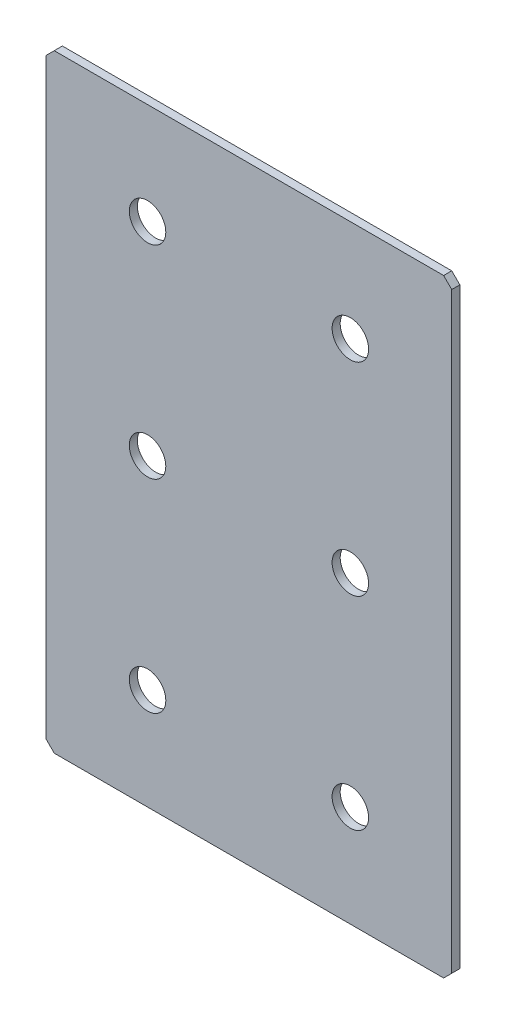
ISO-10303-21;
HEADER;
FILE_DESCRIPTION(('STEP AP214'),'2;1');
FILE_NAME('part.step','',(''),(''),'','','');
FILE_SCHEMA(('AUTOMOTIVE_DESIGN { 1 0 10303 214 1 1 1 1 }'));
ENDSEC;
DATA;
#1=APPLICATION_CONTEXT('core data for automotive mechanical design processes');
#2=APPLICATION_PROTOCOL_DEFINITION('international standard','automotive_design',2000,#1);
#3=PRODUCT_CONTEXT('',#1,'mechanical');
#4=PRODUCT('Part','Part','',(#3));
#5=PRODUCT_RELATED_PRODUCT_CATEGORY('part','',(#4));
#6=PRODUCT_DEFINITION_FORMATION('','',#4);
#7=PRODUCT_DEFINITION_CONTEXT('part definition',#1,'design');
#8=PRODUCT_DEFINITION('design','',#6,#7);
#9=PRODUCT_DEFINITION_SHAPE('','',#8);
#10=(LENGTH_UNIT() NAMED_UNIT(*) SI_UNIT(.MILLI.,.METRE.));
#11=(NAMED_UNIT(*) PLANE_ANGLE_UNIT() SI_UNIT($,.RADIAN.));
#12=(NAMED_UNIT(*) SI_UNIT($,.STERADIAN.) SOLID_ANGLE_UNIT());
#13=UNCERTAINTY_MEASURE_WITH_UNIT(LENGTH_MEASURE(1.E-05),#10,'distance_accuracy_value','');
#14=(GEOMETRIC_REPRESENTATION_CONTEXT(3) GLOBAL_UNCERTAINTY_ASSIGNED_CONTEXT((#13)) GLOBAL_UNIT_ASSIGNED_CONTEXT((#10,
#11,#12)) REPRESENTATION_CONTEXT('',''));
#15=CARTESIAN_POINT('',(0.,0.,0.));
#16=DIRECTION('',(0.,0.,1.));
#17=DIRECTION('',(1.,0.,0.));
#18=AXIS2_PLACEMENT_3D('',#15,#16,#17);
#19=CARTESIAN_POINT('',(50.,-75.,2.));
#20=DIRECTION('',(-1.,0.,0.));
#21=DIRECTION('',(0.,0.,1.));
#22=AXIS2_PLACEMENT_3D('',#19,#20,#21);
#23=PLANE('',#22);
#24=DIRECTION('',(0.,1.,0.));
#25=VECTOR('',#24,1.);
#26=CARTESIAN_POINT('',(50.,-75.,2.));
#27=LINE('',#26,#25);
#28=CARTESIAN_POINT('',(50.,-73.,2.));
#29=VERTEX_POINT('',#28);
#30=CARTESIAN_POINT('',(50.,73.,2.));
#31=VERTEX_POINT('',#30);
#32=EDGE_CURVE('E128',#29,#31,#27,.T.);
#33=ORIENTED_EDGE('',*,*,#32,.F.);
#34=DIRECTION('',(0.,0.,-1.));
#35=VECTOR('',#34,1.);
#36=CARTESIAN_POINT('',(50.,-73.,2.));
#37=LINE('',#36,#35);
#38=CARTESIAN_POINT('',(50.,-73.,0.));
#39=VERTEX_POINT('',#38);
#40=EDGE_CURVE('E154',#29,#39,#37,.T.);
#41=ORIENTED_EDGE('',*,*,#40,.T.);
#42=DIRECTION('',(0.,1.,0.));
#43=VECTOR('',#42,1.);
#44=CARTESIAN_POINT('',(50.,-75.,0.));
#45=LINE('',#44,#43);
#46=CARTESIAN_POINT('',(50.,73.,0.));
#47=VERTEX_POINT('',#46);
#48=EDGE_CURVE('E162',#39,#47,#45,.T.);
#49=ORIENTED_EDGE('',*,*,#48,.T.);
#50=DIRECTION('',(0.,0.,1.));
#51=VECTOR('',#50,1.);
#52=CARTESIAN_POINT('',(50.,73.,2.));
#53=LINE('',#52,#51);
#54=EDGE_CURVE('E152',#47,#31,#53,.T.);
#55=ORIENTED_EDGE('',*,*,#54,.T.);
#56=EDGE_LOOP('',(#33,#41,#49,#55));
#57=FACE_BOUND('',#56,.T.);
#58=ADVANCED_FACE('F37',(#57),#23,.F.);
#59=CARTESIAN_POINT('',(-50.,75.,2.));
#60=DIRECTION('',(0.,-1.,0.));
#61=DIRECTION('',(0.,0.,-1.));
#62=AXIS2_PLACEMENT_3D('',#59,#60,#61);
#63=PLANE('',#62);
#64=DIRECTION('',(-1.,0.,0.));
#65=VECTOR('',#64,1.);
#66=CARTESIAN_POINT('',(-50.,75.,0.));
#67=LINE('',#66,#65);
#68=CARTESIAN_POINT('',(48.,75.,0.));
#69=VERTEX_POINT('',#68);
#70=CARTESIAN_POINT('',(-48.,75.,0.));
#71=VERTEX_POINT('',#70);
#72=EDGE_CURVE('E133',#69,#71,#67,.T.);
#73=ORIENTED_EDGE('',*,*,#72,.T.);
#74=DIRECTION('',(0.,0.,1.));
#75=VECTOR('',#74,1.);
#76=CARTESIAN_POINT('',(-48.,75.,2.));
#77=LINE('',#76,#75);
#78=CARTESIAN_POINT('',(-48.,75.,2.));
#79=VERTEX_POINT('',#78);
#80=EDGE_CURVE('E11',#71,#79,#77,.T.);
#81=ORIENTED_EDGE('',*,*,#80,.T.);
#82=DIRECTION('',(-1.,0.,0.));
#83=VECTOR('',#82,1.);
#84=CARTESIAN_POINT('',(-50.,75.,2.));
#85=LINE('',#84,#83);
#86=CARTESIAN_POINT('',(48.,75.,2.));
#87=VERTEX_POINT('',#86);
#88=EDGE_CURVE('E131',#87,#79,#85,.T.);
#89=ORIENTED_EDGE('',*,*,#88,.F.);
#90=DIRECTION('',(0.,0.,-1.));
#91=VECTOR('',#90,1.);
#92=CARTESIAN_POINT('',(48.,75.,2.));
#93=LINE('',#92,#91);
#94=EDGE_CURVE('E45',#87,#69,#93,.T.);
#95=ORIENTED_EDGE('',*,*,#94,.T.);
#96=EDGE_LOOP('',(#73,#81,#89,#95));
#97=FACE_BOUND('',#96,.T.);
#98=ADVANCED_FACE('F159',(#97),#63,.F.);
#99=CARTESIAN_POINT('',(-50.,-75.,2.));
#100=DIRECTION('',(1.,0.,0.));
#101=DIRECTION('',(0.,0.,-1.));
#102=AXIS2_PLACEMENT_3D('',#99,#100,#101);
#103=PLANE('',#102);
#104=DIRECTION('',(0.,-1.,0.));
#105=VECTOR('',#104,1.);
#106=CARTESIAN_POINT('',(-50.,-75.,0.));
#107=LINE('',#106,#105);
#108=CARTESIAN_POINT('',(-50.,73.,0.));
#109=VERTEX_POINT('',#108);
#110=CARTESIAN_POINT('',(-50.,-73.,0.));
#111=VERTEX_POINT('',#110);
#112=EDGE_CURVE('E129',#109,#111,#107,.T.);
#113=ORIENTED_EDGE('',*,*,#112,.T.);
#114=DIRECTION('',(0.,0.,1.));
#115=VECTOR('',#114,1.);
#116=CARTESIAN_POINT('',(-50.,-73.,2.));
#117=LINE('',#116,#115);
#118=CARTESIAN_POINT('',(-50.,-73.,2.));
#119=VERTEX_POINT('',#118);
#120=EDGE_CURVE('E107',#111,#119,#117,.T.);
#121=ORIENTED_EDGE('',*,*,#120,.T.);
#122=DIRECTION('',(0.,-1.,0.));
#123=VECTOR('',#122,1.);
#124=CARTESIAN_POINT('',(-50.,-75.,2.));
#125=LINE('',#124,#123);
#126=CARTESIAN_POINT('',(-50.,73.,2.));
#127=VERTEX_POINT('',#126);
#128=EDGE_CURVE('E167',#127,#119,#125,.T.);
#129=ORIENTED_EDGE('',*,*,#128,.F.);
#130=DIRECTION('',(0.,0.,-1.));
#131=VECTOR('',#130,1.);
#132=CARTESIAN_POINT('',(-50.,73.,2.));
#133=LINE('',#132,#131);
#134=EDGE_CURVE('E112',#127,#109,#133,.T.);
#135=ORIENTED_EDGE('',*,*,#134,.T.);
#136=EDGE_LOOP('',(#113,#121,#129,#135));
#137=FACE_BOUND('',#136,.T.);
#138=ADVANCED_FACE('F226',(#137),#103,.F.);
#139=CARTESIAN_POINT('',(-50.,-75.,2.));
#140=DIRECTION('',(0.,1.,0.));
#141=DIRECTION('',(0.,0.,1.));
#142=AXIS2_PLACEMENT_3D('',#139,#140,#141);
#143=PLANE('',#142);
#144=DIRECTION('',(1.,0.,0.));
#145=VECTOR('',#144,1.);
#146=CARTESIAN_POINT('',(-50.,-75.,2.));
#147=LINE('',#146,#145);
#148=CARTESIAN_POINT('',(-48.,-75.,2.));
#149=VERTEX_POINT('',#148);
#150=CARTESIAN_POINT('',(48.,-75.,2.));
#151=VERTEX_POINT('',#150);
#152=EDGE_CURVE('E122',#149,#151,#147,.T.);
#153=ORIENTED_EDGE('',*,*,#152,.F.);
#154=DIRECTION('',(0.,0.,-1.));
#155=VECTOR('',#154,1.);
#156=CARTESIAN_POINT('',(-48.,-75.,2.));
#157=LINE('',#156,#155);
#158=CARTESIAN_POINT('',(-48.,-75.,0.));
#159=VERTEX_POINT('',#158);
#160=EDGE_CURVE('E106',#149,#159,#157,.T.);
#161=ORIENTED_EDGE('',*,*,#160,.T.);
#162=DIRECTION('',(1.,0.,0.));
#163=VECTOR('',#162,1.);
#164=CARTESIAN_POINT('',(-50.,-75.,0.));
#165=LINE('',#164,#163);
#166=CARTESIAN_POINT('',(48.,-75.,0.));
#167=VERTEX_POINT('',#166);
#168=EDGE_CURVE('E119',#159,#167,#165,.T.);
#169=ORIENTED_EDGE('',*,*,#168,.T.);
#170=DIRECTION('',(0.,0.,1.));
#171=VECTOR('',#170,1.);
#172=CARTESIAN_POINT('',(48.,-75.,2.));
#173=LINE('',#172,#171);
#174=EDGE_CURVE('E124',#167,#151,#173,.T.);
#175=ORIENTED_EDGE('',*,*,#174,.T.);
#176=EDGE_LOOP('',(#153,#161,#169,#175));
#177=FACE_BOUND('',#176,.T.);
#178=ADVANCED_FACE('F118',(#177),#143,.F.);
#179=CARTESIAN_POINT('',(0.,0.,2.));
#180=DIRECTION('',(0.,0.,-1.));
#181=DIRECTION('',(-1.,0.,0.));
#182=AXIS2_PLACEMENT_3D('',#179,#180,#181);
#183=PLANE('',#182);
#184=CARTESIAN_POINT('',(-25.,50.,2.));
#185=DIRECTION('',(0.,0.,1.));
#186=DIRECTION('',(1.,0.,0.));
#187=AXIS2_PLACEMENT_3D('',#184,#185,#186);
#188=CIRCLE('',#187,4.49999999999999);
#189=CARTESIAN_POINT('',(-20.5,50.,2.));
#190=VERTEX_POINT('',#189);
#191=EDGE_CURVE('E203',#190,#190,#188,.T.);
#192=ORIENTED_EDGE('',*,*,#191,.F.);
#193=EDGE_LOOP('',(#192));
#194=FACE_BOUND('',#193,.T.);
#195=CARTESIAN_POINT('',(25.,50.,2.));
#196=DIRECTION('',(0.,0.,1.));
#197=DIRECTION('',(1.,0.,0.));
#198=AXIS2_PLACEMENT_3D('',#195,#196,#197);
#199=CIRCLE('',#198,4.49999999999999);
#200=CARTESIAN_POINT('',(29.5,50.,2.));
#201=VERTEX_POINT('',#200);
#202=EDGE_CURVE('E197',#201,#201,#199,.T.);
#203=ORIENTED_EDGE('',*,*,#202,.F.);
#204=EDGE_LOOP('',(#203));
#205=FACE_BOUND('',#204,.T.);
#206=CARTESIAN_POINT('',(25.,0.,2.));
#207=DIRECTION('',(0.,0.,1.));
#208=DIRECTION('',(1.,0.,0.));
#209=AXIS2_PLACEMENT_3D('',#206,#207,#208);
#210=CIRCLE('',#209,4.49999999999999);
#211=CARTESIAN_POINT('',(29.5,0.,2.));
#212=VERTEX_POINT('',#211);
#213=EDGE_CURVE('E191',#212,#212,#210,.T.);
#214=ORIENTED_EDGE('',*,*,#213,.F.);
#215=EDGE_LOOP('',(#214));
#216=FACE_BOUND('',#215,.T.);
#217=CARTESIAN_POINT('',(-25.,0.,2.));
#218=DIRECTION('',(0.,0.,1.));
#219=DIRECTION('',(1.,0.,0.));
#220=AXIS2_PLACEMENT_3D('',#217,#218,#219);
#221=CIRCLE('',#220,4.49999999999999);
#222=CARTESIAN_POINT('',(-20.5,0.,2.));
#223=VERTEX_POINT('',#222);
#224=EDGE_CURVE('E185',#223,#223,#221,.T.);
#225=ORIENTED_EDGE('',*,*,#224,.F.);
#226=EDGE_LOOP('',(#225));
#227=FACE_BOUND('',#226,.T.);
#228=CARTESIAN_POINT('',(-25.,-50.,2.));
#229=DIRECTION('',(0.,0.,1.));
#230=DIRECTION('',(1.,0.,0.));
#231=AXIS2_PLACEMENT_3D('',#228,#229,#230);
#232=CIRCLE('',#231,4.49999999999999);
#233=CARTESIAN_POINT('',(-20.5,-50.,2.));
#234=VERTEX_POINT('',#233);
#235=EDGE_CURVE('E179',#234,#234,#232,.T.);
#236=ORIENTED_EDGE('',*,*,#235,.F.);
#237=EDGE_LOOP('',(#236));
#238=FACE_BOUND('',#237,.T.);
#239=CARTESIAN_POINT('',(25.,-50.,2.));
#240=DIRECTION('',(0.,0.,1.));
#241=DIRECTION('',(1.,0.,0.));
#242=AXIS2_PLACEMENT_3D('',#239,#240,#241);
#243=CIRCLE('',#242,4.49999999999999);
#244=CARTESIAN_POINT('',(29.5,-50.,2.));
#245=VERTEX_POINT('',#244);
#246=EDGE_CURVE('E173',#245,#245,#243,.T.);
#247=ORIENTED_EDGE('',*,*,#246,.F.);
#248=EDGE_LOOP('',(#247));
#249=FACE_BOUND('',#248,.T.);
#250=ORIENTED_EDGE('',*,*,#128,.T.);
#251=DIRECTION('',(-0.707106781186548,0.707106781186548,0.));
#252=VECTOR('',#251,1.);
#253=CARTESIAN_POINT('',(-48.,-75.,2.));
#254=LINE('',#253,#252);
#255=EDGE_CURVE('E150',#119,#149,#254,.F.);
#256=ORIENTED_EDGE('',*,*,#255,.T.);
#257=ORIENTED_EDGE('',*,*,#152,.T.);
#258=DIRECTION('',(-0.707106781186548,-0.707106781186548,0.));
#259=VECTOR('',#258,1.);
#260=CARTESIAN_POINT('',(50.,-73.,2.));
#261=LINE('',#260,#259);
#262=EDGE_CURVE('E148',#151,#29,#261,.F.);
#263=ORIENTED_EDGE('',*,*,#262,.T.);
#264=ORIENTED_EDGE('',*,*,#32,.T.);
#265=DIRECTION('',(0.707106781186548,-0.707106781186548,0.));
#266=VECTOR('',#265,1.);
#267=CARTESIAN_POINT('',(48.,75.,2.));
#268=LINE('',#267,#266);
#269=EDGE_CURVE('E57',#31,#87,#268,.F.);
#270=ORIENTED_EDGE('',*,*,#269,.T.);
#271=ORIENTED_EDGE('',*,*,#88,.T.);
#272=DIRECTION('',(0.707106781186548,0.707106781186548,0.));
#273=VECTOR('',#272,1.);
#274=CARTESIAN_POINT('',(-50.,73.,2.));
#275=LINE('',#274,#273);
#276=EDGE_CURVE('E146',#79,#127,#275,.F.);
#277=ORIENTED_EDGE('',*,*,#276,.T.);
#278=EDGE_LOOP('',(#250,#256,#257,#263,#264,#270,#271,#277));
#279=FACE_BOUND('',#278,.T.);
#280=ADVANCED_FACE('F209',(#194,#205,#216,#227,#238,#249,#279),#183,.F.);
#281=CARTESIAN_POINT('',(0.,0.,0.));
#282=DIRECTION('',(0.,0.,-1.));
#283=DIRECTION('',(-1.,0.,0.));
#284=AXIS2_PLACEMENT_3D('',#281,#282,#283);
#285=PLANE('',#284);
#286=CARTESIAN_POINT('',(-25.,50.,0.));
#287=DIRECTION('',(0.,0.,1.));
#288=DIRECTION('',(1.,0.,0.));
#289=AXIS2_PLACEMENT_3D('',#286,#287,#288);
#290=CIRCLE('',#289,4.49999999999999);
#291=CARTESIAN_POINT('',(-20.5,50.,0.));
#292=VERTEX_POINT('',#291);
#293=EDGE_CURVE('E200',#292,#292,#290,.T.);
#294=ORIENTED_EDGE('',*,*,#293,.T.);
#295=EDGE_LOOP('',(#294));
#296=FACE_BOUND('',#295,.T.);
#297=CARTESIAN_POINT('',(25.,50.,0.));
#298=DIRECTION('',(0.,0.,1.));
#299=DIRECTION('',(1.,0.,0.));
#300=AXIS2_PLACEMENT_3D('',#297,#298,#299);
#301=CIRCLE('',#300,4.49999999999999);
#302=CARTESIAN_POINT('',(29.5,50.,0.));
#303=VERTEX_POINT('',#302);
#304=EDGE_CURVE('E194',#303,#303,#301,.T.);
#305=ORIENTED_EDGE('',*,*,#304,.T.);
#306=EDGE_LOOP('',(#305));
#307=FACE_BOUND('',#306,.T.);
#308=CARTESIAN_POINT('',(25.,0.,0.));
#309=DIRECTION('',(0.,0.,1.));
#310=DIRECTION('',(1.,0.,0.));
#311=AXIS2_PLACEMENT_3D('',#308,#309,#310);
#312=CIRCLE('',#311,4.49999999999999);
#313=CARTESIAN_POINT('',(29.5,0.,0.));
#314=VERTEX_POINT('',#313);
#315=EDGE_CURVE('E188',#314,#314,#312,.T.);
#316=ORIENTED_EDGE('',*,*,#315,.T.);
#317=EDGE_LOOP('',(#316));
#318=FACE_BOUND('',#317,.T.);
#319=CARTESIAN_POINT('',(-25.,0.,0.));
#320=DIRECTION('',(0.,0.,1.));
#321=DIRECTION('',(1.,0.,0.));
#322=AXIS2_PLACEMENT_3D('',#319,#320,#321);
#323=CIRCLE('',#322,4.49999999999999);
#324=CARTESIAN_POINT('',(-20.5,0.,0.));
#325=VERTEX_POINT('',#324);
#326=EDGE_CURVE('E182',#325,#325,#323,.T.);
#327=ORIENTED_EDGE('',*,*,#326,.T.);
#328=EDGE_LOOP('',(#327));
#329=FACE_BOUND('',#328,.T.);
#330=CARTESIAN_POINT('',(-25.,-50.,0.));
#331=DIRECTION('',(0.,0.,1.));
#332=DIRECTION('',(1.,0.,0.));
#333=AXIS2_PLACEMENT_3D('',#330,#331,#332);
#334=CIRCLE('',#333,4.49999999999999);
#335=CARTESIAN_POINT('',(-20.5,-50.,0.));
#336=VERTEX_POINT('',#335);
#337=EDGE_CURVE('E176',#336,#336,#334,.T.);
#338=ORIENTED_EDGE('',*,*,#337,.T.);
#339=EDGE_LOOP('',(#338));
#340=FACE_BOUND('',#339,.T.);
#341=CARTESIAN_POINT('',(25.,-50.,0.));
#342=DIRECTION('',(0.,0.,1.));
#343=DIRECTION('',(1.,0.,0.));
#344=AXIS2_PLACEMENT_3D('',#341,#342,#343);
#345=CIRCLE('',#344,4.49999999999999);
#346=CARTESIAN_POINT('',(29.5,-50.,0.));
#347=VERTEX_POINT('',#346);
#348=EDGE_CURVE('E163',#347,#347,#345,.T.);
#349=ORIENTED_EDGE('',*,*,#348,.T.);
#350=EDGE_LOOP('',(#349));
#351=FACE_BOUND('',#350,.T.);
#352=ORIENTED_EDGE('',*,*,#168,.F.);
#353=DIRECTION('',(0.707106781186548,-0.707106781186548,0.));
#354=VECTOR('',#353,1.);
#355=CARTESIAN_POINT('',(-61.5,-61.5,0.));
#356=LINE('',#355,#354);
#357=EDGE_CURVE('E102',#159,#111,#356,.F.);
#358=ORIENTED_EDGE('',*,*,#357,.T.);
#359=ORIENTED_EDGE('',*,*,#112,.F.);
#360=DIRECTION('',(-0.707106781186548,-0.707106781186548,0.));
#361=VECTOR('',#360,1.);
#362=CARTESIAN_POINT('',(-61.5,61.5,0.));
#363=LINE('',#362,#361);
#364=EDGE_CURVE('E139',#109,#71,#363,.F.);
#365=ORIENTED_EDGE('',*,*,#364,.T.);
#366=ORIENTED_EDGE('',*,*,#72,.F.);
#367=DIRECTION('',(-0.707106781186548,0.707106781186548,0.));
#368=VECTOR('',#367,1.);
#369=CARTESIAN_POINT('',(61.5,61.5,0.));
#370=LINE('',#369,#368);
#371=EDGE_CURVE('E123',#69,#47,#370,.F.);
#372=ORIENTED_EDGE('',*,*,#371,.T.);
#373=ORIENTED_EDGE('',*,*,#48,.F.);
#374=DIRECTION('',(0.707106781186548,0.707106781186548,0.));
#375=VECTOR('',#374,1.);
#376=CARTESIAN_POINT('',(61.5,-61.5,0.));
#377=LINE('',#376,#375);
#378=EDGE_CURVE('E113',#39,#167,#377,.F.);
#379=ORIENTED_EDGE('',*,*,#378,.T.);
#380=EDGE_LOOP('',(#352,#358,#359,#365,#366,#372,#373,#379));
#381=FACE_BOUND('',#380,.T.);
#382=ADVANCED_FACE('F126',(#296,#307,#318,#329,#340,#351,#381),#285,.T.);
#383=CARTESIAN_POINT('',(-48.,-75.,2.));
#384=DIRECTION('',(0.707106781186547,0.707106781186547,0.));
#385=DIRECTION('',(0.,0.,-1.));
#386=AXIS2_PLACEMENT_3D('',#383,#384,#385);
#387=PLANE('',#386);
#388=ORIENTED_EDGE('',*,*,#255,.F.);
#389=ORIENTED_EDGE('',*,*,#120,.F.);
#390=ORIENTED_EDGE('',*,*,#357,.F.);
#391=ORIENTED_EDGE('',*,*,#160,.F.);
#392=EDGE_LOOP('',(#388,#389,#390,#391));
#393=FACE_BOUND('',#392,.T.);
#394=ADVANCED_FACE('F105',(#393),#387,.F.);
#395=CARTESIAN_POINT('',(50.,-73.,2.));
#396=DIRECTION('',(-0.707106781186547,0.707106781186547,0.));
#397=DIRECTION('',(0.,0.,-1.));
#398=AXIS2_PLACEMENT_3D('',#395,#396,#397);
#399=PLANE('',#398);
#400=ORIENTED_EDGE('',*,*,#262,.F.);
#401=ORIENTED_EDGE('',*,*,#174,.F.);
#402=ORIENTED_EDGE('',*,*,#378,.F.);
#403=ORIENTED_EDGE('',*,*,#40,.F.);
#404=EDGE_LOOP('',(#400,#401,#402,#403));
#405=FACE_BOUND('',#404,.T.);
#406=ADVANCED_FACE('F230',(#405),#399,.F.);
#407=CARTESIAN_POINT('',(-50.,73.,2.));
#408=DIRECTION('',(0.707106781186547,-0.707106781186547,0.));
#409=DIRECTION('',(0.,0.,-1.));
#410=AXIS2_PLACEMENT_3D('',#407,#408,#409);
#411=PLANE('',#410);
#412=ORIENTED_EDGE('',*,*,#276,.F.);
#413=ORIENTED_EDGE('',*,*,#80,.F.);
#414=ORIENTED_EDGE('',*,*,#364,.F.);
#415=ORIENTED_EDGE('',*,*,#134,.F.);
#416=EDGE_LOOP('',(#412,#413,#414,#415));
#417=FACE_BOUND('',#416,.T.);
#418=ADVANCED_FACE('F228',(#417),#411,.F.);
#419=CARTESIAN_POINT('',(48.,75.,2.));
#420=DIRECTION('',(-0.707106781186547,-0.707106781186547,0.));
#421=DIRECTION('',(0.,0.,-1.));
#422=AXIS2_PLACEMENT_3D('',#419,#420,#421);
#423=PLANE('',#422);
#424=ORIENTED_EDGE('',*,*,#269,.F.);
#425=ORIENTED_EDGE('',*,*,#54,.F.);
#426=ORIENTED_EDGE('',*,*,#371,.F.);
#427=ORIENTED_EDGE('',*,*,#94,.F.);
#428=EDGE_LOOP('',(#424,#425,#426,#427));
#429=FACE_BOUND('',#428,.T.);
#430=ADVANCED_FACE('F39',(#429),#423,.F.);
#431=CARTESIAN_POINT('',(25.,-50.,2.));
#432=DIRECTION('',(0.,0.,1.));
#433=DIRECTION('',(1.,0.,0.));
#434=AXIS2_PLACEMENT_3D('',#431,#432,#433);
#435=CYLINDRICAL_SURFACE('',#434,4.49999999999999);
#436=ORIENTED_EDGE('',*,*,#348,.F.);
#437=EDGE_LOOP('',(#436));
#438=FACE_BOUND('',#437,.T.);
#439=ORIENTED_EDGE('',*,*,#246,.T.);
#440=EDGE_LOOP('',(#439));
#441=FACE_BOUND('',#440,.T.);
#442=ADVANCED_FACE('F235',(#438,#441),#435,.F.);
#443=CARTESIAN_POINT('',(-25.,-50.,2.));
#444=DIRECTION('',(0.,0.,1.));
#445=DIRECTION('',(1.,0.,0.));
#446=AXIS2_PLACEMENT_3D('',#443,#444,#445);
#447=CYLINDRICAL_SURFACE('',#446,4.49999999999999);
#448=ORIENTED_EDGE('',*,*,#337,.F.);
#449=EDGE_LOOP('',(#448));
#450=FACE_BOUND('',#449,.T.);
#451=ORIENTED_EDGE('',*,*,#235,.T.);
#452=EDGE_LOOP('',(#451));
#453=FACE_BOUND('',#452,.T.);
#454=ADVANCED_FACE('F290',(#450,#453),#447,.F.);
#455=CARTESIAN_POINT('',(-25.,0.,2.));
#456=DIRECTION('',(0.,0.,1.));
#457=DIRECTION('',(1.,0.,0.));
#458=AXIS2_PLACEMENT_3D('',#455,#456,#457);
#459=CYLINDRICAL_SURFACE('',#458,4.49999999999999);
#460=ORIENTED_EDGE('',*,*,#326,.F.);
#461=EDGE_LOOP('',(#460));
#462=FACE_BOUND('',#461,.T.);
#463=ORIENTED_EDGE('',*,*,#224,.T.);
#464=EDGE_LOOP('',(#463));
#465=FACE_BOUND('',#464,.T.);
#466=ADVANCED_FACE('F299',(#462,#465),#459,.F.);
#467=CARTESIAN_POINT('',(25.,0.,2.));
#468=DIRECTION('',(0.,0.,1.));
#469=DIRECTION('',(1.,0.,0.));
#470=AXIS2_PLACEMENT_3D('',#467,#468,#469);
#471=CYLINDRICAL_SURFACE('',#470,4.49999999999999);
#472=ORIENTED_EDGE('',*,*,#315,.F.);
#473=EDGE_LOOP('',(#472));
#474=FACE_BOUND('',#473,.T.);
#475=ORIENTED_EDGE('',*,*,#213,.T.);
#476=EDGE_LOOP('',(#475));
#477=FACE_BOUND('',#476,.T.);
#478=ADVANCED_FACE('F309',(#474,#477),#471,.F.);
#479=CARTESIAN_POINT('',(25.,50.,2.));
#480=DIRECTION('',(0.,0.,1.));
#481=DIRECTION('',(1.,0.,0.));
#482=AXIS2_PLACEMENT_3D('',#479,#480,#481);
#483=CYLINDRICAL_SURFACE('',#482,4.49999999999999);
#484=ORIENTED_EDGE('',*,*,#304,.F.);
#485=EDGE_LOOP('',(#484));
#486=FACE_BOUND('',#485,.T.);
#487=ORIENTED_EDGE('',*,*,#202,.T.);
#488=EDGE_LOOP('',(#487));
#489=FACE_BOUND('',#488,.T.);
#490=ADVANCED_FACE('F319',(#486,#489),#483,.F.);
#491=CARTESIAN_POINT('',(-25.,50.,2.));
#492=DIRECTION('',(0.,0.,1.));
#493=DIRECTION('',(1.,0.,0.));
#494=AXIS2_PLACEMENT_3D('',#491,#492,#493);
#495=CYLINDRICAL_SURFACE('',#494,4.49999999999999);
#496=ORIENTED_EDGE('',*,*,#293,.F.);
#497=EDGE_LOOP('',(#496));
#498=FACE_BOUND('',#497,.T.);
#499=ORIENTED_EDGE('',*,*,#191,.T.);
#500=EDGE_LOOP('',(#499));
#501=FACE_BOUND('',#500,.T.);
#502=ADVANCED_FACE('F207',(#498,#501),#495,.F.);
#503=CLOSED_SHELL('',(#58,#98,#138,#178,#280,#382,#394,#406,#418,#430,#442,#454,#466,#478,#490,#502));
#504=MANIFOLD_SOLID_BREP('B2',#503);
#505=ADVANCED_BREP_SHAPE_REPRESENTATION('',(#18,#504),#14);
#506=SHAPE_DEFINITION_REPRESENTATION(#9,#505);
ENDSEC;
END-ISO-10303-21;
